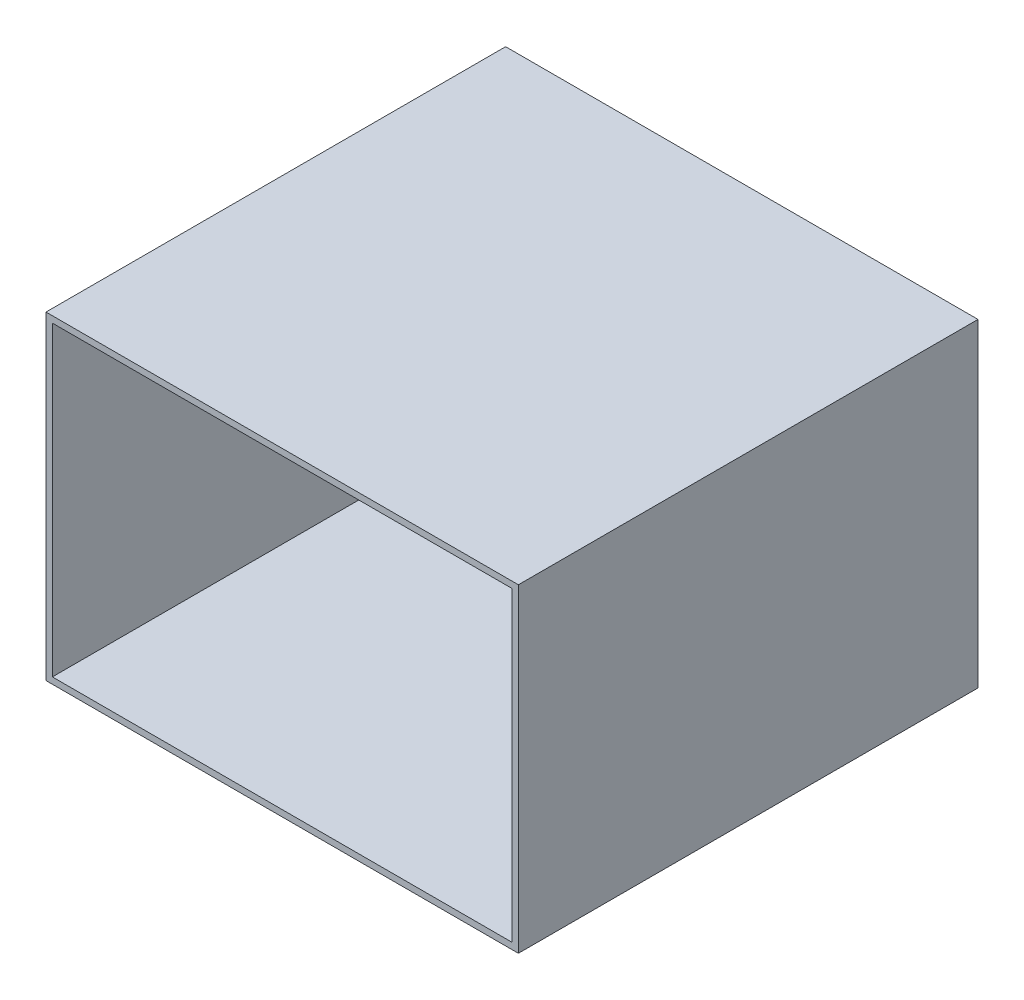
ISO-10303-21;
HEADER;
FILE_DESCRIPTION(('STEP AP214'),'2;1');
FILE_NAME('part.step','',(''),(''),'','','');
FILE_SCHEMA(('AUTOMOTIVE_DESIGN { 1 0 10303 214 1 1 1 1 }'));
ENDSEC;
DATA;
#1=APPLICATION_CONTEXT('core data for automotive mechanical design processes');
#2=APPLICATION_PROTOCOL_DEFINITION('international standard','automotive_design',2000,#1);
#3=PRODUCT_CONTEXT('',#1,'mechanical');
#4=PRODUCT('Part','Part','',(#3));
#5=PRODUCT_RELATED_PRODUCT_CATEGORY('part','',(#4));
#6=PRODUCT_DEFINITION_FORMATION('','',#4);
#7=PRODUCT_DEFINITION_CONTEXT('part definition',#1,'design');
#8=PRODUCT_DEFINITION('design','',#6,#7);
#9=PRODUCT_DEFINITION_SHAPE('','',#8);
#10=(LENGTH_UNIT() NAMED_UNIT(*) SI_UNIT(.MILLI.,.METRE.));
#11=(NAMED_UNIT(*) PLANE_ANGLE_UNIT() SI_UNIT($,.RADIAN.));
#12=(NAMED_UNIT(*) SI_UNIT($,.STERADIAN.) SOLID_ANGLE_UNIT());
#13=UNCERTAINTY_MEASURE_WITH_UNIT(LENGTH_MEASURE(1.E-05),#10,'distance_accuracy_value','');
#14=(GEOMETRIC_REPRESENTATION_CONTEXT(3) GLOBAL_UNCERTAINTY_ASSIGNED_CONTEXT((#13)) GLOBAL_UNIT_ASSIGNED_CONTEXT((#10,
#11,#12)) REPRESENTATION_CONTEXT('',''));
#15=CARTESIAN_POINT('',(0.,0.,0.));
#16=DIRECTION('',(0.,0.,1.));
#17=DIRECTION('',(1.,0.,0.));
#18=AXIS2_PLACEMENT_3D('',#15,#16,#17);
#19=CARTESIAN_POINT('',(0.,0.,6.35));
#20=DIRECTION('',(0.,0.,-1.));
#21=DIRECTION('',(-1.,0.,0.));
#22=AXIS2_PLACEMENT_3D('',#19,#20,#21);
#23=PLANE('',#22);
#24=DIRECTION('',(0.,-1.,0.));
#25=VECTOR('',#24,1.);
#26=CARTESIAN_POINT('',(0.,0.,6.35));
#27=LINE('',#26,#25);
#28=CARTESIAN_POINT('',(0.,304.8,6.35));
#29=VERTEX_POINT('',#28);
#30=CARTESIAN_POINT('',(0.,0.,6.35));
#31=VERTEX_POINT('',#30);
#32=EDGE_CURVE('E197',#29,#31,#27,.T.);
#33=ORIENTED_EDGE('',*,*,#32,.T.);
#34=DIRECTION('',(1.,0.,0.));
#35=VECTOR('',#34,1.);
#36=CARTESIAN_POINT('',(0.,0.,6.35));
#37=LINE('',#36,#35);
#38=CARTESIAN_POINT('',(457.2,0.,6.35));
#39=VERTEX_POINT('',#38);
#40=EDGE_CURVE('E203',#31,#39,#37,.T.);
#41=ORIENTED_EDGE('',*,*,#40,.T.);
#42=DIRECTION('',(0.,1.,0.));
#43=VECTOR('',#42,1.);
#44=CARTESIAN_POINT('',(457.2,0.,6.35));
#45=LINE('',#44,#43);
#46=CARTESIAN_POINT('',(457.2,304.8,6.35));
#47=VERTEX_POINT('',#46);
#48=EDGE_CURVE('E52',#39,#47,#45,.T.);
#49=ORIENTED_EDGE('',*,*,#48,.T.);
#50=DIRECTION('',(-1.,0.,0.));
#51=VECTOR('',#50,1.);
#52=CARTESIAN_POINT('',(0.,304.8,6.35));
#53=LINE('',#52,#51);
#54=EDGE_CURVE('E11',#47,#29,#53,.T.);
#55=ORIENTED_EDGE('',*,*,#54,.T.);
#56=EDGE_LOOP('',(#33,#41,#49,#55));
#57=FACE_BOUND('',#56,.T.);
#58=CARTESIAN_POINT('',(228.6,152.4,6.35));
#59=DIRECTION('',(0.,0.,1.));
#60=DIRECTION('',(1.,0.,0.));
#61=AXIS2_PLACEMENT_3D('',#58,#59,#60);
#62=CIRCLE('',#61,25.4);
#63=CARTESIAN_POINT('',(254.,152.4,6.35));
#64=VERTEX_POINT('',#63);
#65=EDGE_CURVE('E193',#64,#64,#62,.T.);
#66=ORIENTED_EDGE('',*,*,#65,.F.);
#67=EDGE_LOOP('',(#66));
#68=FACE_BOUND('',#67,.T.);
#69=ADVANCED_FACE('F43',(#57,#68),#23,.F.);
#70=CARTESIAN_POINT('',(0.,0.,0.));
#71=DIRECTION('',(0.,0.,-1.));
#72=DIRECTION('',(-1.,0.,0.));
#73=AXIS2_PLACEMENT_3D('',#70,#71,#72);
#74=PLANE('',#73);
#75=DIRECTION('',(1.,0.,0.));
#76=VECTOR('',#75,1.);
#77=CARTESIAN_POINT('',(0.,-6.35,0.));
#78=LINE('',#77,#76);
#79=CARTESIAN_POINT('',(-6.35,-6.35,0.));
#80=VERTEX_POINT('',#79);
#81=CARTESIAN_POINT('',(463.55,-6.35,0.));
#82=VERTEX_POINT('',#81);
#83=EDGE_CURVE('E109',#80,#82,#78,.T.);
#84=ORIENTED_EDGE('',*,*,#83,.F.);
#85=DIRECTION('',(0.,-1.,0.));
#86=VECTOR('',#85,1.);
#87=CARTESIAN_POINT('',(-6.35,311.15,0.));
#88=LINE('',#87,#86);
#89=CARTESIAN_POINT('',(-6.35,311.15,0.));
#90=VERTEX_POINT('',#89);
#91=EDGE_CURVE('E114',#90,#80,#88,.T.);
#92=ORIENTED_EDGE('',*,*,#91,.F.);
#93=DIRECTION('',(-1.,0.,0.));
#94=VECTOR('',#93,1.);
#95=CARTESIAN_POINT('',(0.,311.15,0.));
#96=LINE('',#95,#94);
#97=CARTESIAN_POINT('',(463.55,311.15,0.));
#98=VERTEX_POINT('',#97);
#99=EDGE_CURVE('E169',#98,#90,#96,.T.);
#100=ORIENTED_EDGE('',*,*,#99,.F.);
#101=DIRECTION('',(0.,1.,0.));
#102=VECTOR('',#101,1.);
#103=CARTESIAN_POINT('',(463.55,0.,0.));
#104=LINE('',#103,#102);
#105=EDGE_CURVE('E115',#82,#98,#104,.T.);
#106=ORIENTED_EDGE('',*,*,#105,.F.);
#107=EDGE_LOOP('',(#84,#92,#100,#106));
#108=FACE_BOUND('',#107,.T.);
#109=CARTESIAN_POINT('',(228.6,152.4,0.));
#110=DIRECTION('',(0.,0.,1.));
#111=DIRECTION('',(1.,0.,0.));
#112=AXIS2_PLACEMENT_3D('',#109,#110,#111);
#113=CIRCLE('',#112,25.4);
#114=CARTESIAN_POINT('',(254.,152.4,0.));
#115=VERTEX_POINT('',#114);
#116=EDGE_CURVE('E184',#115,#115,#113,.T.);
#117=ORIENTED_EDGE('',*,*,#116,.T.);
#118=EDGE_LOOP('',(#117));
#119=FACE_BOUND('',#118,.T.);
#120=ADVANCED_FACE('F45',(#108,#119),#74,.T.);
#121=CARTESIAN_POINT('',(228.6,152.4,6.35));
#122=DIRECTION('',(0.,0.,-1.));
#123=DIRECTION('',(-1.,0.,0.));
#124=AXIS2_PLACEMENT_3D('',#121,#122,#123);
#125=CYLINDRICAL_SURFACE('',#124,25.4);
#126=ORIENTED_EDGE('',*,*,#65,.T.);
#127=EDGE_LOOP('',(#126));
#128=FACE_BOUND('',#127,.T.);
#129=ORIENTED_EDGE('',*,*,#116,.F.);
#130=EDGE_LOOP('',(#129));
#131=FACE_BOUND('',#130,.T.);
#132=ADVANCED_FACE('F224',(#128,#131),#125,.F.);
#133=CARTESIAN_POINT('',(463.55,0.,457.2));
#134=DIRECTION('',(0.,0.,-1.));
#135=DIRECTION('',(-1.,0.,0.));
#136=AXIS2_PLACEMENT_3D('',#133,#134,#135);
#137=PLANE('',#136);
#138=DIRECTION('',(-1.,0.,0.));
#139=VECTOR('',#138,1.);
#140=CARTESIAN_POINT('',(0.,0.,457.2));
#141=LINE('',#140,#139);
#142=CARTESIAN_POINT('',(457.2,0.,457.2));
#143=VERTEX_POINT('',#142);
#144=CARTESIAN_POINT('',(0.,0.,457.2));
#145=VERTEX_POINT('',#144);
#146=EDGE_CURVE('E121',#143,#145,#141,.T.);
#147=ORIENTED_EDGE('',*,*,#146,.T.);
#148=DIRECTION('',(0.,1.,0.));
#149=VECTOR('',#148,1.);
#150=CARTESIAN_POINT('',(0.,311.15,457.2));
#151=LINE('',#150,#149);
#152=CARTESIAN_POINT('',(0.,304.8,457.2));
#153=VERTEX_POINT('',#152);
#154=EDGE_CURVE('E139',#145,#153,#151,.T.);
#155=ORIENTED_EDGE('',*,*,#154,.T.);
#156=DIRECTION('',(1.,0.,0.));
#157=VECTOR('',#156,1.);
#158=CARTESIAN_POINT('',(0.,304.8,457.2));
#159=LINE('',#158,#157);
#160=CARTESIAN_POINT('',(457.2,304.8,457.2));
#161=VERTEX_POINT('',#160);
#162=EDGE_CURVE('E165',#153,#161,#159,.T.);
#163=ORIENTED_EDGE('',*,*,#162,.T.);
#164=DIRECTION('',(0.,-1.,0.));
#165=VECTOR('',#164,1.);
#166=CARTESIAN_POINT('',(457.2,0.,457.2));
#167=LINE('',#166,#165);
#168=EDGE_CURVE('E187',#161,#143,#167,.T.);
#169=ORIENTED_EDGE('',*,*,#168,.T.);
#170=EDGE_LOOP('',(#147,#155,#163,#169));
#171=FACE_BOUND('',#170,.T.);
#172=DIRECTION('',(0.,1.,0.));
#173=VECTOR('',#172,1.);
#174=CARTESIAN_POINT('',(-6.35,311.15,457.2));
#175=LINE('',#174,#173);
#176=CARTESIAN_POINT('',(-6.35,-6.35,457.2));
#177=VERTEX_POINT('',#176);
#178=CARTESIAN_POINT('',(-6.35,311.15,457.2));
#179=VERTEX_POINT('',#178);
#180=EDGE_CURVE('E132',#177,#179,#175,.T.);
#181=ORIENTED_EDGE('',*,*,#180,.F.);
#182=DIRECTION('',(-1.,0.,0.));
#183=VECTOR('',#182,1.);
#184=CARTESIAN_POINT('',(0.,-6.35,457.2));
#185=LINE('',#184,#183);
#186=CARTESIAN_POINT('',(463.55,-6.35,457.2));
#187=VERTEX_POINT('',#186);
#188=EDGE_CURVE('E127',#187,#177,#185,.T.);
#189=ORIENTED_EDGE('',*,*,#188,.F.);
#190=DIRECTION('',(0.,-1.,0.));
#191=VECTOR('',#190,1.);
#192=CARTESIAN_POINT('',(463.55,0.,457.2));
#193=LINE('',#192,#191);
#194=CARTESIAN_POINT('',(463.55,311.15,457.2));
#195=VERTEX_POINT('',#194);
#196=EDGE_CURVE('E180',#195,#187,#193,.T.);
#197=ORIENTED_EDGE('',*,*,#196,.F.);
#198=DIRECTION('',(1.,0.,0.));
#199=VECTOR('',#198,1.);
#200=CARTESIAN_POINT('',(0.,311.15,457.2));
#201=LINE('',#200,#199);
#202=EDGE_CURVE('E160',#179,#195,#201,.T.);
#203=ORIENTED_EDGE('',*,*,#202,.F.);
#204=EDGE_LOOP('',(#181,#189,#197,#203));
#205=FACE_BOUND('',#204,.T.);
#206=ADVANCED_FACE('F220',(#171,#205),#137,.F.);
#207=CARTESIAN_POINT('',(463.55,0.,0.));
#208=DIRECTION('',(1.,0.,0.));
#209=DIRECTION('',(0.,0.,-1.));
#210=AXIS2_PLACEMENT_3D('',#207,#208,#209);
#211=PLANE('',#210);
#212=ORIENTED_EDGE('',*,*,#105,.T.);
#213=DIRECTION('',(0.,0.,-1.));
#214=VECTOR('',#213,1.);
#215=CARTESIAN_POINT('',(463.55,311.15,0.));
#216=LINE('',#215,#214);
#217=EDGE_CURVE('E164',#195,#98,#216,.T.);
#218=ORIENTED_EDGE('',*,*,#217,.F.);
#219=ORIENTED_EDGE('',*,*,#196,.T.);
#220=DIRECTION('',(0.,0.,1.));
#221=VECTOR('',#220,1.);
#222=CARTESIAN_POINT('',(463.55,-6.35,0.));
#223=LINE('',#222,#221);
#224=EDGE_CURVE('E120',#82,#187,#223,.T.);
#225=ORIENTED_EDGE('',*,*,#224,.F.);
#226=EDGE_LOOP('',(#212,#218,#219,#225));
#227=FACE_BOUND('',#226,.T.);
#228=ADVANCED_FACE('F223',(#227),#211,.T.);
#229=CARTESIAN_POINT('',(457.2,0.,0.));
#230=DIRECTION('',(1.,0.,0.));
#231=DIRECTION('',(0.,0.,-1.));
#232=AXIS2_PLACEMENT_3D('',#229,#230,#231);
#233=PLANE('',#232);
#234=ORIENTED_EDGE('',*,*,#48,.F.);
#235=DIRECTION('',(0.,0.,-1.));
#236=VECTOR('',#235,1.);
#237=CARTESIAN_POINT('',(457.2,0.,0.));
#238=LINE('',#237,#236);
#239=EDGE_CURVE('E181',#143,#39,#238,.T.);
#240=ORIENTED_EDGE('',*,*,#239,.F.);
#241=ORIENTED_EDGE('',*,*,#168,.F.);
#242=DIRECTION('',(0.,0.,1.));
#243=VECTOR('',#242,1.);
#244=CARTESIAN_POINT('',(457.2,304.8,0.));
#245=LINE('',#244,#243);
#246=EDGE_CURVE('E65',#47,#161,#245,.T.);
#247=ORIENTED_EDGE('',*,*,#246,.F.);
#248=EDGE_LOOP('',(#234,#240,#241,#247));
#249=FACE_BOUND('',#248,.T.);
#250=ADVANCED_FACE('F218',(#249),#233,.F.);
#251=CARTESIAN_POINT('',(0.,311.15,0.));
#252=DIRECTION('',(0.,1.,0.));
#253=DIRECTION('',(0.,0.,1.));
#254=AXIS2_PLACEMENT_3D('',#251,#252,#253);
#255=PLANE('',#254);
#256=ORIENTED_EDGE('',*,*,#99,.T.);
#257=DIRECTION('',(0.,0.,-1.));
#258=VECTOR('',#257,1.);
#259=CARTESIAN_POINT('',(-6.35,311.15,0.));
#260=LINE('',#259,#258);
#261=EDGE_CURVE('E137',#179,#90,#260,.T.);
#262=ORIENTED_EDGE('',*,*,#261,.F.);
#263=ORIENTED_EDGE('',*,*,#202,.T.);
#264=ORIENTED_EDGE('',*,*,#217,.T.);
#265=EDGE_LOOP('',(#256,#262,#263,#264));
#266=FACE_BOUND('',#265,.T.);
#267=ADVANCED_FACE('F227',(#266),#255,.T.);
#268=CARTESIAN_POINT('',(0.,304.8,0.));
#269=DIRECTION('',(0.,1.,0.));
#270=DIRECTION('',(0.,0.,1.));
#271=AXIS2_PLACEMENT_3D('',#268,#269,#270);
#272=PLANE('',#271);
#273=ORIENTED_EDGE('',*,*,#54,.F.);
#274=ORIENTED_EDGE('',*,*,#246,.T.);
#275=ORIENTED_EDGE('',*,*,#162,.F.);
#276=DIRECTION('',(0.,0.,1.));
#277=VECTOR('',#276,1.);
#278=CARTESIAN_POINT('',(0.,304.8,0.));
#279=LINE('',#278,#277);
#280=EDGE_CURVE('E154',#29,#153,#279,.T.);
#281=ORIENTED_EDGE('',*,*,#280,.F.);
#282=EDGE_LOOP('',(#273,#274,#275,#281));
#283=FACE_BOUND('',#282,.T.);
#284=ADVANCED_FACE('F210',(#283),#272,.F.);
#285=CARTESIAN_POINT('',(0.,-6.35,0.));
#286=DIRECTION('',(0.,1.,0.));
#287=DIRECTION('',(0.,0.,1.));
#288=AXIS2_PLACEMENT_3D('',#285,#286,#287);
#289=PLANE('',#288);
#290=ORIENTED_EDGE('',*,*,#188,.T.);
#291=DIRECTION('',(0.,0.,1.));
#292=VECTOR('',#291,1.);
#293=CARTESIAN_POINT('',(-6.35,-6.35,0.));
#294=LINE('',#293,#292);
#295=EDGE_CURVE('E124',#80,#177,#294,.T.);
#296=ORIENTED_EDGE('',*,*,#295,.F.);
#297=ORIENTED_EDGE('',*,*,#83,.T.);
#298=ORIENTED_EDGE('',*,*,#224,.T.);
#299=EDGE_LOOP('',(#290,#296,#297,#298));
#300=FACE_BOUND('',#299,.T.);
#301=ADVANCED_FACE('F125',(#300),#289,.F.);
#302=CARTESIAN_POINT('',(0.,0.,0.));
#303=DIRECTION('',(0.,1.,0.));
#304=DIRECTION('',(0.,0.,1.));
#305=AXIS2_PLACEMENT_3D('',#302,#303,#304);
#306=PLANE('',#305);
#307=ORIENTED_EDGE('',*,*,#146,.F.);
#308=ORIENTED_EDGE('',*,*,#239,.T.);
#309=ORIENTED_EDGE('',*,*,#40,.F.);
#310=DIRECTION('',(0.,0.,-1.));
#311=VECTOR('',#310,1.);
#312=CARTESIAN_POINT('',(0.,0.,0.));
#313=LINE('',#312,#311);
#314=EDGE_CURVE('E148',#145,#31,#313,.T.);
#315=ORIENTED_EDGE('',*,*,#314,.F.);
#316=EDGE_LOOP('',(#307,#308,#309,#315));
#317=FACE_BOUND('',#316,.T.);
#318=ADVANCED_FACE('F217',(#317),#306,.T.);
#319=CARTESIAN_POINT('',(0.,0.,0.));
#320=DIRECTION('',(-1.,0.,0.));
#321=DIRECTION('',(0.,0.,1.));
#322=AXIS2_PLACEMENT_3D('',#319,#320,#321);
#323=PLANE('',#322);
#324=ORIENTED_EDGE('',*,*,#154,.F.);
#325=ORIENTED_EDGE('',*,*,#314,.T.);
#326=ORIENTED_EDGE('',*,*,#32,.F.);
#327=ORIENTED_EDGE('',*,*,#280,.T.);
#328=EDGE_LOOP('',(#324,#325,#326,#327));
#329=FACE_BOUND('',#328,.T.);
#330=ADVANCED_FACE('F214',(#329),#323,.F.);
#331=CARTESIAN_POINT('',(-6.35,0.,0.));
#332=DIRECTION('',(-1.,0.,0.));
#333=DIRECTION('',(0.,0.,1.));
#334=AXIS2_PLACEMENT_3D('',#331,#332,#333);
#335=PLANE('',#334);
#336=ORIENTED_EDGE('',*,*,#91,.T.);
#337=ORIENTED_EDGE('',*,*,#295,.T.);
#338=ORIENTED_EDGE('',*,*,#180,.T.);
#339=ORIENTED_EDGE('',*,*,#261,.T.);
#340=EDGE_LOOP('',(#336,#337,#338,#339));
#341=FACE_BOUND('',#340,.T.);
#342=ADVANCED_FACE('F135',(#341),#335,.T.);
#343=CLOSED_SHELL('',(#69,#120,#132,#206,#228,#250,#267,#284,#301,#318,#330,#342));
#344=MANIFOLD_SOLID_BREP('B2',#343);
#345=ADVANCED_BREP_SHAPE_REPRESENTATION('',(#18,#344),#14);
#346=SHAPE_DEFINITION_REPRESENTATION(#9,#345);
ENDSEC;
END-ISO-10303-21;
